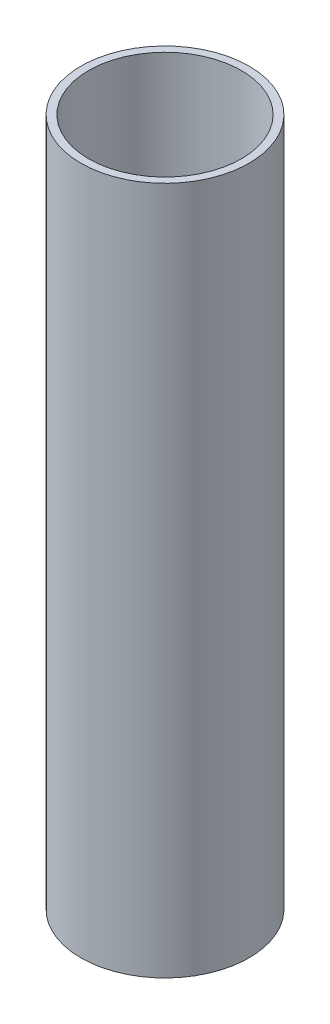
ISO-10303-21;
HEADER;
FILE_DESCRIPTION(('STEP AP214'),'2;1');
FILE_NAME('part.step','',(''),(''),'','','');
FILE_SCHEMA(('AUTOMOTIVE_DESIGN { 1 0 10303 214 1 1 1 1 }'));
ENDSEC;
DATA;
#1=APPLICATION_CONTEXT('core data for automotive mechanical design processes');
#2=APPLICATION_PROTOCOL_DEFINITION('international standard','automotive_design',2000,#1);
#3=PRODUCT_CONTEXT('',#1,'mechanical');
#4=PRODUCT('Part','Part','',(#3));
#5=PRODUCT_RELATED_PRODUCT_CATEGORY('part','',(#4));
#6=PRODUCT_DEFINITION_FORMATION('','',#4);
#7=PRODUCT_DEFINITION_CONTEXT('part definition',#1,'design');
#8=PRODUCT_DEFINITION('design','',#6,#7);
#9=PRODUCT_DEFINITION_SHAPE('','',#8);
#10=(LENGTH_UNIT() NAMED_UNIT(*) SI_UNIT(.MILLI.,.METRE.));
#11=(NAMED_UNIT(*) PLANE_ANGLE_UNIT() SI_UNIT($,.RADIAN.));
#12=(NAMED_UNIT(*) SI_UNIT($,.STERADIAN.) SOLID_ANGLE_UNIT());
#13=UNCERTAINTY_MEASURE_WITH_UNIT(LENGTH_MEASURE(1.E-05),#10,'distance_accuracy_value','');
#14=(GEOMETRIC_REPRESENTATION_CONTEXT(3) GLOBAL_UNCERTAINTY_ASSIGNED_CONTEXT((#13)) GLOBAL_UNIT_ASSIGNED_CONTEXT((#10,
#11,#12)) REPRESENTATION_CONTEXT('',''));
#15=CARTESIAN_POINT('',(0.,0.,0.));
#16=DIRECTION('',(0.,0.,1.));
#17=DIRECTION('',(1.,0.,0.));
#18=AXIS2_PLACEMENT_3D('',#15,#16,#17);
#19=CARTESIAN_POINT('',(0.,90.,0.));
#20=DIRECTION('',(0.,1.,0.));
#21=DIRECTION('',(0.,0.,1.));
#22=AXIS2_PLACEMENT_3D('',#19,#20,#21);
#23=PLANE('',#22);
#24=CARTESIAN_POINT('',(0.,90.,0.));
#25=DIRECTION('',(0.,1.,0.));
#26=DIRECTION('',(0.,0.,1.));
#27=AXIS2_PLACEMENT_3D('',#24,#25,#26);
#28=CIRCLE('',#27,11.);
#29=CARTESIAN_POINT('',(0.,90.,11.));
#30=VERTEX_POINT('',#29);
#31=EDGE_CURVE('E10',#30,#30,#28,.T.);
#32=ORIENTED_EDGE('',*,*,#31,.T.);
#33=EDGE_LOOP('',(#32));
#34=FACE_BOUND('',#33,.T.);
#35=CARTESIAN_POINT('',(0.,90.,0.));
#36=DIRECTION('',(0.,1.,0.));
#37=DIRECTION('',(0.,0.,1.));
#38=AXIS2_PLACEMENT_3D('',#35,#36,#37);
#39=CIRCLE('',#38,10.);
#40=CARTESIAN_POINT('',(0.,90.,10.));
#41=VERTEX_POINT('',#40);
#42=EDGE_CURVE('E46',#41,#41,#39,.T.);
#43=ORIENTED_EDGE('',*,*,#42,.F.);
#44=EDGE_LOOP('',(#43));
#45=FACE_BOUND('',#44,.T.);
#46=ADVANCED_FACE('F35',(#34,#45),#23,.T.);
#47=CARTESIAN_POINT('',(0.,0.,0.));
#48=DIRECTION('',(0.,1.,0.));
#49=DIRECTION('',(0.,0.,1.));
#50=AXIS2_PLACEMENT_3D('',#47,#48,#49);
#51=PLANE('',#50);
#52=CARTESIAN_POINT('',(0.,0.,0.));
#53=DIRECTION('',(0.,1.,0.));
#54=DIRECTION('',(0.,0.,1.));
#55=AXIS2_PLACEMENT_3D('',#52,#53,#54);
#56=CIRCLE('',#55,11.);
#57=CARTESIAN_POINT('',(0.,0.,11.));
#58=VERTEX_POINT('',#57);
#59=EDGE_CURVE('E39',#58,#58,#56,.T.);
#60=ORIENTED_EDGE('',*,*,#59,.F.);
#61=EDGE_LOOP('',(#60));
#62=FACE_BOUND('',#61,.T.);
#63=CARTESIAN_POINT('',(0.,0.,0.));
#64=DIRECTION('',(0.,1.,0.));
#65=DIRECTION('',(0.,0.,1.));
#66=AXIS2_PLACEMENT_3D('',#63,#64,#65);
#67=CIRCLE('',#66,10.);
#68=CARTESIAN_POINT('',(0.,0.,10.));
#69=VERTEX_POINT('',#68);
#70=EDGE_CURVE('E48',#69,#69,#67,.T.);
#71=ORIENTED_EDGE('',*,*,#70,.T.);
#72=EDGE_LOOP('',(#71));
#73=FACE_BOUND('',#72,.T.);
#74=ADVANCED_FACE('F58',(#62,#73),#51,.F.);
#75=CARTESIAN_POINT('',(0.,90.,0.));
#76=DIRECTION('',(0.,-1.,0.));
#77=DIRECTION('',(0.,0.,-1.));
#78=AXIS2_PLACEMENT_3D('',#75,#76,#77);
#79=CYLINDRICAL_SURFACE('',#78,11.);
#80=ORIENTED_EDGE('',*,*,#31,.F.);
#81=EDGE_LOOP('',(#80));
#82=FACE_BOUND('',#81,.T.);
#83=ORIENTED_EDGE('',*,*,#59,.T.);
#84=EDGE_LOOP('',(#83));
#85=FACE_BOUND('',#84,.T.);
#86=ADVANCED_FACE('F37',(#82,#85),#79,.T.);
#87=CARTESIAN_POINT('',(0.,90.,0.));
#88=DIRECTION('',(0.,-1.,0.));
#89=DIRECTION('',(0.,0.,-1.));
#90=AXIS2_PLACEMENT_3D('',#87,#88,#89);
#91=CYLINDRICAL_SURFACE('',#90,10.);
#92=ORIENTED_EDGE('',*,*,#42,.T.);
#93=EDGE_LOOP('',(#92));
#94=FACE_BOUND('',#93,.T.);
#95=ORIENTED_EDGE('',*,*,#70,.F.);
#96=EDGE_LOOP('',(#95));
#97=FACE_BOUND('',#96,.T.);
#98=ADVANCED_FACE('F54',(#94,#97),#91,.F.);
#99=CLOSED_SHELL('',(#46,#74,#86,#98));
#100=MANIFOLD_SOLID_BREP('B2',#99);
#101=ADVANCED_BREP_SHAPE_REPRESENTATION('',(#18,#100),#14);
#102=SHAPE_DEFINITION_REPRESENTATION(#9,#101);
ENDSEC;
END-ISO-10303-21;
